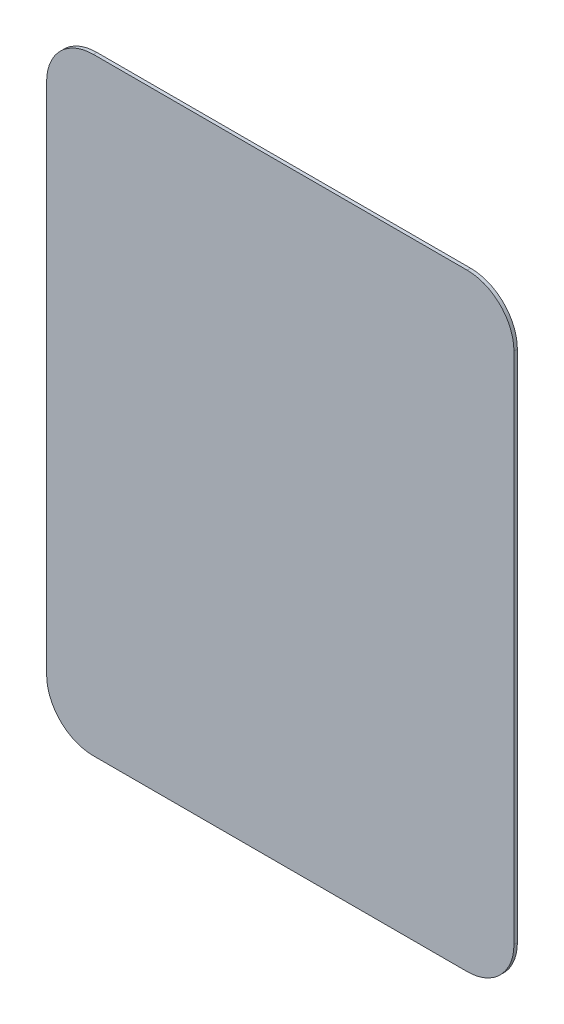
ISO-10303-21;
HEADER;
FILE_DESCRIPTION(('STEP AP214'),'2;1');
FILE_NAME('part.step','',(''),(''),'','','');
FILE_SCHEMA(('AUTOMOTIVE_DESIGN { 1 0 10303 214 1 1 1 1 }'));
ENDSEC;
DATA;
#1=APPLICATION_CONTEXT('core data for automotive mechanical design processes');
#2=APPLICATION_PROTOCOL_DEFINITION('international standard','automotive_design',2000,#1);
#3=PRODUCT_CONTEXT('',#1,'mechanical');
#4=PRODUCT('Part','Part','',(#3));
#5=PRODUCT_RELATED_PRODUCT_CATEGORY('part','',(#4));
#6=PRODUCT_DEFINITION_FORMATION('','',#4);
#7=PRODUCT_DEFINITION_CONTEXT('part definition',#1,'design');
#8=PRODUCT_DEFINITION('design','',#6,#7);
#9=PRODUCT_DEFINITION_SHAPE('','',#8);
#10=(LENGTH_UNIT() NAMED_UNIT(*) SI_UNIT(.MILLI.,.METRE.));
#11=(NAMED_UNIT(*) PLANE_ANGLE_UNIT() SI_UNIT($,.RADIAN.));
#12=(NAMED_UNIT(*) SI_UNIT($,.STERADIAN.) SOLID_ANGLE_UNIT());
#13=UNCERTAINTY_MEASURE_WITH_UNIT(LENGTH_MEASURE(1.E-05),#10,'distance_accuracy_value','');
#14=(GEOMETRIC_REPRESENTATION_CONTEXT(3) GLOBAL_UNCERTAINTY_ASSIGNED_CONTEXT((#13)) GLOBAL_UNIT_ASSIGNED_CONTEXT((#10,
#11,#12)) REPRESENTATION_CONTEXT('',''));
#15=CARTESIAN_POINT('',(0.,0.,0.));
#16=DIRECTION('',(0.,0.,1.));
#17=DIRECTION('',(1.,0.,0.));
#18=AXIS2_PLACEMENT_3D('',#15,#16,#17);
#19=CARTESIAN_POINT('',(-70.0869565217391,54.2608695652174,-0.7366));
#20=DIRECTION('',(-1.,0.,0.));
#21=DIRECTION('',(0.,0.,1.));
#22=AXIS2_PLACEMENT_3D('',#19,#20,#21);
#23=PLANE('',#22);
#24=DIRECTION('',(0.,-1.,0.));
#25=VECTOR('',#24,1.);
#26=CARTESIAN_POINT('',(-70.0869565217391,54.2608695652174,0.));
#27=LINE('',#26,#25);
#28=CARTESIAN_POINT('',(-70.0869565217391,44.2608695652174,0.));
#29=VERTEX_POINT('',#28);
#30=CARTESIAN_POINT('',(-70.0869565217391,-65.7391304347826,0.));
#31=VERTEX_POINT('',#30);
#32=EDGE_CURVE('E165',#29,#31,#27,.T.);
#33=ORIENTED_EDGE('',*,*,#32,.F.);
#34=DIRECTION('',(0.,0.,1.));
#35=VECTOR('',#34,1.);
#36=CARTESIAN_POINT('',(-70.0869565217391,44.2608695652174,-0.7366));
#37=LINE('',#36,#35);
#38=CARTESIAN_POINT('',(-70.0869565217391,44.2608695652174,-0.7366));
#39=VERTEX_POINT('',#38);
#40=EDGE_CURVE('E145',#29,#39,#37,.F.);
#41=ORIENTED_EDGE('',*,*,#40,.T.);
#42=DIRECTION('',(0.,-1.,0.));
#43=VECTOR('',#42,1.);
#44=CARTESIAN_POINT('',(-70.0869565217391,54.2608695652174,-0.7366));
#45=LINE('',#44,#43);
#46=CARTESIAN_POINT('',(-70.0869565217391,-65.7391304347826,-0.7366));
#47=VERTEX_POINT('',#46);
#48=EDGE_CURVE('E126',#39,#47,#45,.T.);
#49=ORIENTED_EDGE('',*,*,#48,.T.);
#50=DIRECTION('',(0.,0.,1.));
#51=VECTOR('',#50,1.);
#52=CARTESIAN_POINT('',(-70.0869565217391,-65.7391304347826,-0.7366));
#53=LINE('',#52,#51);
#54=EDGE_CURVE('E142',#47,#31,#53,.T.);
#55=ORIENTED_EDGE('',*,*,#54,.T.);
#56=EDGE_LOOP('',(#33,#41,#49,#55));
#57=FACE_BOUND('',#56,.T.);
#58=ADVANCED_FACE('F39',(#57),#23,.T.);
#59=CARTESIAN_POINT('',(-70.0869565217391,54.2608695652174,-0.7366));
#60=DIRECTION('',(0.,1.,0.));
#61=DIRECTION('',(0.,0.,1.));
#62=AXIS2_PLACEMENT_3D('',#59,#60,#61);
#63=PLANE('',#62);
#64=DIRECTION('',(-1.,0.,0.));
#65=VECTOR('',#64,1.);
#66=CARTESIAN_POINT('',(-70.0869565217391,54.2608695652174,-0.7366));
#67=LINE('',#66,#65);
#68=CARTESIAN_POINT('',(19.9130434782609,54.2608695652174,-0.7366));
#69=VERTEX_POINT('',#68);
#70=CARTESIAN_POINT('',(-60.0869565217391,54.2608695652174,-0.7366));
#71=VERTEX_POINT('',#70);
#72=EDGE_CURVE('E131',#69,#71,#67,.T.);
#73=ORIENTED_EDGE('',*,*,#72,.T.);
#74=DIRECTION('',(0.,0.,1.));
#75=VECTOR('',#74,1.);
#76=CARTESIAN_POINT('',(-60.0869565217391,54.2608695652174,-0.7366));
#77=LINE('',#76,#75);
#78=CARTESIAN_POINT('',(-60.0869565217391,54.2608695652174,0.));
#79=VERTEX_POINT('',#78);
#80=EDGE_CURVE('E125',#71,#79,#77,.T.);
#81=ORIENTED_EDGE('',*,*,#80,.T.);
#82=DIRECTION('',(-1.,0.,0.));
#83=VECTOR('',#82,1.);
#84=CARTESIAN_POINT('',(-70.0869565217391,54.2608695652174,0.));
#85=LINE('',#84,#83);
#86=CARTESIAN_POINT('',(19.9130434782609,54.2608695652174,0.));
#87=VERTEX_POINT('',#86);
#88=EDGE_CURVE('E108',#87,#79,#85,.T.);
#89=ORIENTED_EDGE('',*,*,#88,.F.);
#90=DIRECTION('',(0.,0.,1.));
#91=VECTOR('',#90,1.);
#92=CARTESIAN_POINT('',(19.9130434782609,54.2608695652174,-0.7366));
#93=LINE('',#92,#91);
#94=EDGE_CURVE('E122',#87,#69,#93,.F.);
#95=ORIENTED_EDGE('',*,*,#94,.T.);
#96=EDGE_LOOP('',(#73,#81,#89,#95));
#97=FACE_BOUND('',#96,.T.);
#98=ADVANCED_FACE('F121',(#97),#63,.T.);
#99=CARTESIAN_POINT('',(29.9130434782609,54.2608695652174,-0.7366));
#100=DIRECTION('',(1.,0.,0.));
#101=DIRECTION('',(0.,1.,0.));
#102=AXIS2_PLACEMENT_3D('',#99,#100,#101);
#103=PLANE('',#102);
#104=DIRECTION('',(0.,1.,0.));
#105=VECTOR('',#104,1.);
#106=CARTESIAN_POINT('',(29.9130434782609,54.2608695652174,-0.7366));
#107=LINE('',#106,#105);
#108=CARTESIAN_POINT('',(29.9130434782609,-65.7391304347826,-0.7366));
#109=VERTEX_POINT('',#108);
#110=CARTESIAN_POINT('',(29.9130434782609,44.2608695652174,-0.7366));
#111=VERTEX_POINT('',#110);
#112=EDGE_CURVE('E135',#109,#111,#107,.T.);
#113=ORIENTED_EDGE('',*,*,#112,.T.);
#114=DIRECTION('',(0.,0.,1.));
#115=VECTOR('',#114,1.);
#116=CARTESIAN_POINT('',(29.9130434782609,44.2608695652174,-0.7366));
#117=LINE('',#116,#115);
#118=CARTESIAN_POINT('',(29.9130434782609,44.2608695652174,0.));
#119=VERTEX_POINT('',#118);
#120=EDGE_CURVE('E155',#111,#119,#117,.T.);
#121=ORIENTED_EDGE('',*,*,#120,.T.);
#122=DIRECTION('',(0.,1.,0.));
#123=VECTOR('',#122,1.);
#124=CARTESIAN_POINT('',(29.9130434782609,54.2608695652174,0.));
#125=LINE('',#124,#123);
#126=CARTESIAN_POINT('',(29.9130434782609,-65.7391304347826,0.));
#127=VERTEX_POINT('',#126);
#128=EDGE_CURVE('E110',#127,#119,#125,.T.);
#129=ORIENTED_EDGE('',*,*,#128,.F.);
#130=DIRECTION('',(0.,0.,1.));
#131=VECTOR('',#130,1.);
#132=CARTESIAN_POINT('',(29.9130434782609,-65.7391304347826,-0.7366));
#133=LINE('',#132,#131);
#134=EDGE_CURVE('E153',#127,#109,#133,.F.);
#135=ORIENTED_EDGE('',*,*,#134,.T.);
#136=EDGE_LOOP('',(#113,#121,#129,#135));
#137=FACE_BOUND('',#136,.T.);
#138=ADVANCED_FACE('F158',(#137),#103,.T.);
#139=CARTESIAN_POINT('',(-70.0869565217391,-75.7391304347826,-0.7366));
#140=DIRECTION('',(0.,-1.,0.));
#141=DIRECTION('',(0.,0.,-1.));
#142=AXIS2_PLACEMENT_3D('',#139,#140,#141);
#143=PLANE('',#142);
#144=DIRECTION('',(1.,0.,0.));
#145=VECTOR('',#144,1.);
#146=CARTESIAN_POINT('',(-70.0869565217391,-75.7391304347826,-0.7366));
#147=LINE('',#146,#145);
#148=CARTESIAN_POINT('',(-60.0869565217391,-75.7391304347826,-0.7366));
#149=VERTEX_POINT('',#148);
#150=CARTESIAN_POINT('',(19.9130434782609,-75.7391304347826,-0.7366));
#151=VERTEX_POINT('',#150);
#152=EDGE_CURVE('E160',#149,#151,#147,.T.);
#153=ORIENTED_EDGE('',*,*,#152,.T.);
#154=DIRECTION('',(0.,0.,1.));
#155=VECTOR('',#154,1.);
#156=CARTESIAN_POINT('',(19.9130434782609,-75.7391304347826,-0.7366));
#157=LINE('',#156,#155);
#158=CARTESIAN_POINT('',(19.9130434782609,-75.7391304347826,0.));
#159=VERTEX_POINT('',#158);
#160=EDGE_CURVE('E11',#151,#159,#157,.T.);
#161=ORIENTED_EDGE('',*,*,#160,.T.);
#162=DIRECTION('',(1.,0.,0.));
#163=VECTOR('',#162,1.);
#164=CARTESIAN_POINT('',(-70.0869565217391,-75.7391304347826,0.));
#165=LINE('',#164,#163);
#166=CARTESIAN_POINT('',(-60.0869565217391,-75.7391304347826,0.));
#167=VERTEX_POINT('',#166);
#168=EDGE_CURVE('E168',#167,#159,#165,.T.);
#169=ORIENTED_EDGE('',*,*,#168,.F.);
#170=DIRECTION('',(0.,0.,1.));
#171=VECTOR('',#170,1.);
#172=CARTESIAN_POINT('',(-60.0869565217391,-75.7391304347826,-0.7366));
#173=LINE('',#172,#171);
#174=EDGE_CURVE('E47',#167,#149,#173,.F.);
#175=ORIENTED_EDGE('',*,*,#174,.T.);
#176=EDGE_LOOP('',(#153,#161,#169,#175));
#177=FACE_BOUND('',#176,.T.);
#178=ADVANCED_FACE('F170',(#177),#143,.T.);
#179=CARTESIAN_POINT('',(0.,0.,-0.7366));
#180=DIRECTION('',(0.,0.,1.));
#181=DIRECTION('',(1.,0.,0.));
#182=AXIS2_PLACEMENT_3D('',#179,#180,#181);
#183=PLANE('',#182);
#184=ORIENTED_EDGE('',*,*,#48,.F.);
#185=CARTESIAN_POINT('',(-60.0869565217391,44.2608695652174,-0.7366));
#186=DIRECTION('',(0.,0.,1.));
#187=DIRECTION('',(1.,0.,0.));
#188=AXIS2_PLACEMENT_3D('',#185,#186,#187);
#189=CIRCLE('',#188,10.);
#190=EDGE_CURVE('E151',#39,#71,#189,.F.);
#191=ORIENTED_EDGE('',*,*,#190,.T.);
#192=ORIENTED_EDGE('',*,*,#72,.F.);
#193=CARTESIAN_POINT('',(19.9130434782609,44.2608695652174,-0.7366));
#194=DIRECTION('',(0.,0.,1.));
#195=DIRECTION('',(1.,0.,0.));
#196=AXIS2_PLACEMENT_3D('',#193,#194,#195);
#197=CIRCLE('',#196,10.);
#198=EDGE_CURVE('E130',#69,#111,#197,.F.);
#199=ORIENTED_EDGE('',*,*,#198,.T.);
#200=ORIENTED_EDGE('',*,*,#112,.F.);
#201=CARTESIAN_POINT('',(19.9130434782609,-65.7391304347826,-0.7366));
#202=DIRECTION('',(0.,0.,1.));
#203=DIRECTION('',(1.,0.,0.));
#204=AXIS2_PLACEMENT_3D('',#201,#202,#203);
#205=CIRCLE('',#204,10.);
#206=EDGE_CURVE('E54',#109,#151,#205,.F.);
#207=ORIENTED_EDGE('',*,*,#206,.T.);
#208=ORIENTED_EDGE('',*,*,#152,.F.);
#209=CARTESIAN_POINT('',(-60.0869565217391,-65.7391304347826,-0.7366));
#210=DIRECTION('',(0.,0.,1.));
#211=DIRECTION('',(1.,0.,0.));
#212=AXIS2_PLACEMENT_3D('',#209,#210,#211);
#213=CIRCLE('',#212,10.);
#214=EDGE_CURVE('E147',#149,#47,#213,.F.);
#215=ORIENTED_EDGE('',*,*,#214,.T.);
#216=EDGE_LOOP('',(#184,#191,#192,#199,#200,#207,#208,#215));
#217=FACE_BOUND('',#216,.T.);
#218=ADVANCED_FACE('F177',(#217),#183,.F.);
#219=CARTESIAN_POINT('',(0.,0.,0.));
#220=DIRECTION('',(0.,0.,1.));
#221=DIRECTION('',(1.,0.,0.));
#222=AXIS2_PLACEMENT_3D('',#219,#220,#221);
#223=PLANE('',#222);
#224=ORIENTED_EDGE('',*,*,#88,.T.);
#225=CARTESIAN_POINT('',(-60.0869565217391,44.2608695652174,0.));
#226=DIRECTION('',(0.,0.,1.));
#227=DIRECTION('',(1.,0.,0.));
#228=AXIS2_PLACEMENT_3D('',#225,#226,#227);
#229=CIRCLE('',#228,10.);
#230=EDGE_CURVE('E115',#79,#29,#229,.T.);
#231=ORIENTED_EDGE('',*,*,#230,.T.);
#232=ORIENTED_EDGE('',*,*,#32,.T.);
#233=CARTESIAN_POINT('',(-60.0869565217391,-65.7391304347826,0.));
#234=DIRECTION('',(0.,0.,1.));
#235=DIRECTION('',(1.,0.,0.));
#236=AXIS2_PLACEMENT_3D('',#233,#234,#235);
#237=CIRCLE('',#236,10.);
#238=EDGE_CURVE('E133',#31,#167,#237,.T.);
#239=ORIENTED_EDGE('',*,*,#238,.T.);
#240=ORIENTED_EDGE('',*,*,#168,.T.);
#241=CARTESIAN_POINT('',(19.9130434782609,-65.7391304347826,0.));
#242=DIRECTION('',(0.,0.,1.));
#243=DIRECTION('',(1.,0.,0.));
#244=AXIS2_PLACEMENT_3D('',#241,#242,#243);
#245=CIRCLE('',#244,10.);
#246=EDGE_CURVE('E116',#159,#127,#245,.T.);
#247=ORIENTED_EDGE('',*,*,#246,.T.);
#248=ORIENTED_EDGE('',*,*,#128,.T.);
#249=CARTESIAN_POINT('',(19.9130434782609,44.2608695652174,0.));
#250=DIRECTION('',(0.,0.,1.));
#251=DIRECTION('',(1.,0.,0.));
#252=AXIS2_PLACEMENT_3D('',#249,#250,#251);
#253=CIRCLE('',#252,10.);
#254=EDGE_CURVE('E105',#119,#87,#253,.T.);
#255=ORIENTED_EDGE('',*,*,#254,.T.);
#256=EDGE_LOOP('',(#224,#231,#232,#239,#240,#247,#248,#255));
#257=FACE_BOUND('',#256,.T.);
#258=ADVANCED_FACE('F107',(#257),#223,.T.);
#259=CARTESIAN_POINT('',(-60.0869565217391,44.2608695652174,-0.7366));
#260=DIRECTION('',(0.,0.,1.));
#261=DIRECTION('',(1.,0.,0.));
#262=AXIS2_PLACEMENT_3D('',#259,#260,#261);
#263=CYLINDRICAL_SURFACE('',#262,10.);
#264=ORIENTED_EDGE('',*,*,#190,.F.);
#265=ORIENTED_EDGE('',*,*,#40,.F.);
#266=ORIENTED_EDGE('',*,*,#230,.F.);
#267=ORIENTED_EDGE('',*,*,#80,.F.);
#268=EDGE_LOOP('',(#264,#265,#266,#267));
#269=FACE_BOUND('',#268,.T.);
#270=ADVANCED_FACE('F183',(#269),#263,.T.);
#271=CARTESIAN_POINT('',(19.9130434782609,44.2608695652174,-0.7366));
#272=DIRECTION('',(0.,0.,1.));
#273=DIRECTION('',(1.,0.,0.));
#274=AXIS2_PLACEMENT_3D('',#271,#272,#273);
#275=CYLINDRICAL_SURFACE('',#274,10.);
#276=ORIENTED_EDGE('',*,*,#198,.F.);
#277=ORIENTED_EDGE('',*,*,#94,.F.);
#278=ORIENTED_EDGE('',*,*,#254,.F.);
#279=ORIENTED_EDGE('',*,*,#120,.F.);
#280=EDGE_LOOP('',(#276,#277,#278,#279));
#281=FACE_BOUND('',#280,.T.);
#282=ADVANCED_FACE('F129',(#281),#275,.T.);
#283=CARTESIAN_POINT('',(19.9130434782609,-65.7391304347826,-0.7366));
#284=DIRECTION('',(0.,0.,1.));
#285=DIRECTION('',(1.,0.,0.));
#286=AXIS2_PLACEMENT_3D('',#283,#284,#285);
#287=CYLINDRICAL_SURFACE('',#286,10.);
#288=ORIENTED_EDGE('',*,*,#206,.F.);
#289=ORIENTED_EDGE('',*,*,#134,.F.);
#290=ORIENTED_EDGE('',*,*,#246,.F.);
#291=ORIENTED_EDGE('',*,*,#160,.F.);
#292=EDGE_LOOP('',(#288,#289,#290,#291));
#293=FACE_BOUND('',#292,.T.);
#294=ADVANCED_FACE('F190',(#293),#287,.T.);
#295=CARTESIAN_POINT('',(-60.0869565217391,-65.7391304347826,-0.7366));
#296=DIRECTION('',(0.,0.,1.));
#297=DIRECTION('',(1.,0.,0.));
#298=AXIS2_PLACEMENT_3D('',#295,#296,#297);
#299=CYLINDRICAL_SURFACE('',#298,10.);
#300=ORIENTED_EDGE('',*,*,#214,.F.);
#301=ORIENTED_EDGE('',*,*,#174,.F.);
#302=ORIENTED_EDGE('',*,*,#238,.F.);
#303=ORIENTED_EDGE('',*,*,#54,.F.);
#304=EDGE_LOOP('',(#300,#301,#302,#303));
#305=FACE_BOUND('',#304,.T.);
#306=ADVANCED_FACE('F41',(#305),#299,.T.);
#307=CLOSED_SHELL('',(#58,#98,#138,#178,#218,#258,#270,#282,#294,#306));
#308=MANIFOLD_SOLID_BREP('B2',#307);
#309=ADVANCED_BREP_SHAPE_REPRESENTATION('',(#18,#308),#14);
#310=SHAPE_DEFINITION_REPRESENTATION(#9,#309);
ENDSEC;
END-ISO-10303-21;
